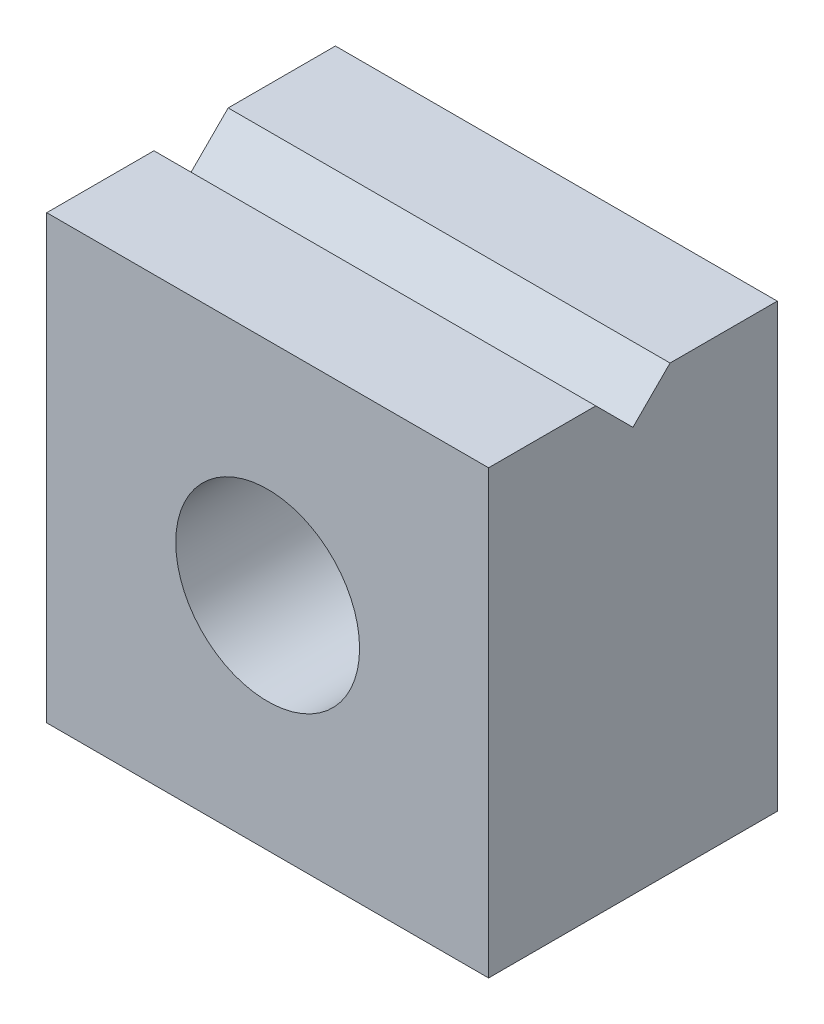
ISO-10303-21;
HEADER;
FILE_DESCRIPTION(('STEP AP214'),'2;1');
FILE_NAME('part.step','',(''),(''),'','','');
FILE_SCHEMA(('AUTOMOTIVE_DESIGN { 1 0 10303 214 1 1 1 1 }'));
ENDSEC;
DATA;
#1=APPLICATION_CONTEXT('core data for automotive mechanical design processes');
#2=APPLICATION_PROTOCOL_DEFINITION('international standard','automotive_design',2000,#1);
#3=PRODUCT_CONTEXT('',#1,'mechanical');
#4=PRODUCT('Part','Part','',(#3));
#5=PRODUCT_RELATED_PRODUCT_CATEGORY('part','',(#4));
#6=PRODUCT_DEFINITION_FORMATION('','',#4);
#7=PRODUCT_DEFINITION_CONTEXT('part definition',#1,'design');
#8=PRODUCT_DEFINITION('design','',#6,#7);
#9=PRODUCT_DEFINITION_SHAPE('','',#8);
#10=(LENGTH_UNIT() NAMED_UNIT(*) SI_UNIT(.MILLI.,.METRE.));
#11=(NAMED_UNIT(*) PLANE_ANGLE_UNIT() SI_UNIT($,.RADIAN.));
#12=(NAMED_UNIT(*) SI_UNIT($,.STERADIAN.) SOLID_ANGLE_UNIT());
#13=UNCERTAINTY_MEASURE_WITH_UNIT(LENGTH_MEASURE(1.E-05),#10,'distance_accuracy_value','');
#14=(GEOMETRIC_REPRESENTATION_CONTEXT(3) GLOBAL_UNCERTAINTY_ASSIGNED_CONTEXT((#13)) GLOBAL_UNIT_ASSIGNED_CONTEXT((#10,
#11,#12)) REPRESENTATION_CONTEXT('',''));
#15=CARTESIAN_POINT('',(0.,0.,0.));
#16=DIRECTION('',(0.,0.,1.));
#17=DIRECTION('',(1.,0.,0.));
#18=AXIS2_PLACEMENT_3D('',#15,#16,#17);
#19=CARTESIAN_POINT('',(-3.75,3.75,4.9));
#20=DIRECTION('',(0.,-1.,0.));
#21=DIRECTION('',(0.,0.,-1.));
#22=AXIS2_PLACEMENT_3D('',#19,#20,#21);
#23=PLANE('',#22);
#24=DIRECTION('',(0.,0.,-1.));
#25=VECTOR('',#24,1.);
#26=CARTESIAN_POINT('',(-3.75,3.75,4.9));
#27=LINE('',#26,#25);
#28=CARTESIAN_POINT('',(-3.75,3.75,1.82));
#29=VERTEX_POINT('',#28);
#30=CARTESIAN_POINT('',(-3.75,3.75,0.));
#31=VERTEX_POINT('',#30);
#32=EDGE_CURVE('E122',#29,#31,#27,.T.);
#33=ORIENTED_EDGE('',*,*,#32,.F.);
#34=DIRECTION('',(1.,0.,0.));
#35=VECTOR('',#34,1.);
#36=CARTESIAN_POINT('',(-3.75,3.75,1.82));
#37=LINE('',#36,#35);
#38=CARTESIAN_POINT('',(3.75,3.75,1.82));
#39=VERTEX_POINT('',#38);
#40=EDGE_CURVE('E109',#29,#39,#37,.T.);
#41=ORIENTED_EDGE('',*,*,#40,.T.);
#42=DIRECTION('',(0.,0.,-1.));
#43=VECTOR('',#42,1.);
#44=CARTESIAN_POINT('',(3.75,3.75,4.9));
#45=LINE('',#44,#43);
#46=CARTESIAN_POINT('',(3.75,3.75,0.));
#47=VERTEX_POINT('',#46);
#48=EDGE_CURVE('E48',#39,#47,#45,.T.);
#49=ORIENTED_EDGE('',*,*,#48,.T.);
#50=DIRECTION('',(-1.,0.,0.));
#51=VECTOR('',#50,1.);
#52=CARTESIAN_POINT('',(-3.75,3.75,0.));
#53=LINE('',#52,#51);
#54=EDGE_CURVE('E151',#47,#31,#53,.T.);
#55=ORIENTED_EDGE('',*,*,#54,.T.);
#56=EDGE_LOOP('',(#33,#41,#49,#55));
#57=FACE_BOUND('',#56,.T.);
#58=ADVANCED_FACE('F39',(#57),#23,.F.);
#59=CARTESIAN_POINT('',(0.,0.,4.9));
#60=DIRECTION('',(0.,0.,-1.));
#61=DIRECTION('',(-1.,0.,0.));
#62=AXIS2_PLACEMENT_3D('',#59,#60,#61);
#63=PLANE('',#62);
#64=DIRECTION('',(0.,1.,0.));
#65=VECTOR('',#64,1.);
#66=CARTESIAN_POINT('',(3.75,-3.75,4.9));
#67=LINE('',#66,#65);
#68=CARTESIAN_POINT('',(3.75,-3.75,4.9));
#69=VERTEX_POINT('',#68);
#70=CARTESIAN_POINT('',(3.75,3.75,4.9));
#71=VERTEX_POINT('',#70);
#72=EDGE_CURVE('E147',#69,#71,#67,.T.);
#73=ORIENTED_EDGE('',*,*,#72,.T.);
#74=DIRECTION('',(-1.,0.,0.));
#75=VECTOR('',#74,1.);
#76=CARTESIAN_POINT('',(-3.75,3.75,4.9));
#77=LINE('',#76,#75);
#78=CARTESIAN_POINT('',(-3.75,3.75,4.9));
#79=VERTEX_POINT('',#78);
#80=EDGE_CURVE('E92',#71,#79,#77,.T.);
#81=ORIENTED_EDGE('',*,*,#80,.T.);
#82=DIRECTION('',(0.,-1.,0.));
#83=VECTOR('',#82,1.);
#84=CARTESIAN_POINT('',(-3.75,-3.75,4.9));
#85=LINE('',#84,#83);
#86=CARTESIAN_POINT('',(-3.75,-3.75,4.9));
#87=VERTEX_POINT('',#86);
#88=EDGE_CURVE('E159',#79,#87,#85,.T.);
#89=ORIENTED_EDGE('',*,*,#88,.T.);
#90=DIRECTION('',(1.,0.,0.));
#91=VECTOR('',#90,1.);
#92=CARTESIAN_POINT('',(-3.75,-3.75,4.9));
#93=LINE('',#92,#91);
#94=EDGE_CURVE('E64',#87,#69,#93,.T.);
#95=ORIENTED_EDGE('',*,*,#94,.T.);
#96=EDGE_LOOP('',(#73,#81,#89,#95));
#97=FACE_BOUND('',#96,.T.);
#98=CARTESIAN_POINT('',(0.,0.,4.9));
#99=DIRECTION('',(0.,0.,1.));
#100=DIRECTION('',(1.,0.,0.));
#101=AXIS2_PLACEMENT_3D('',#98,#99,#100);
#102=CIRCLE('',#101,1.56);
#103=CARTESIAN_POINT('',(1.56,0.,4.9));
#104=VERTEX_POINT('',#103);
#105=EDGE_CURVE('E156',#104,#104,#102,.T.);
#106=ORIENTED_EDGE('',*,*,#105,.F.);
#107=EDGE_LOOP('',(#106));
#108=FACE_BOUND('',#107,.T.);
#109=ADVANCED_FACE('F190',(#97,#108),#63,.F.);
#110=CARTESIAN_POINT('',(0.,0.,0.));
#111=DIRECTION('',(0.,0.,-1.));
#112=DIRECTION('',(-1.,0.,0.));
#113=AXIS2_PLACEMENT_3D('',#110,#111,#112);
#114=PLANE('',#113);
#115=DIRECTION('',(0.,1.,0.));
#116=VECTOR('',#115,1.);
#117=CARTESIAN_POINT('',(3.75,-3.75,0.));
#118=LINE('',#117,#116);
#119=CARTESIAN_POINT('',(3.75,-3.75,0.));
#120=VERTEX_POINT('',#119);
#121=EDGE_CURVE('E129',#120,#47,#118,.T.);
#122=ORIENTED_EDGE('',*,*,#121,.F.);
#123=DIRECTION('',(1.,0.,0.));
#124=VECTOR('',#123,1.);
#125=CARTESIAN_POINT('',(-3.75,-3.75,0.));
#126=LINE('',#125,#124);
#127=CARTESIAN_POINT('',(-3.75,-3.75,0.));
#128=VERTEX_POINT('',#127);
#129=EDGE_CURVE('E85',#128,#120,#126,.T.);
#130=ORIENTED_EDGE('',*,*,#129,.F.);
#131=DIRECTION('',(0.,-1.,0.));
#132=VECTOR('',#131,1.);
#133=CARTESIAN_POINT('',(-3.75,-3.75,0.));
#134=LINE('',#133,#132);
#135=EDGE_CURVE('E148',#31,#128,#134,.T.);
#136=ORIENTED_EDGE('',*,*,#135,.F.);
#137=ORIENTED_EDGE('',*,*,#54,.F.);
#138=EDGE_LOOP('',(#122,#130,#136,#137));
#139=FACE_BOUND('',#138,.T.);
#140=CARTESIAN_POINT('',(0.,0.,0.));
#141=DIRECTION('',(0.,0.,1.));
#142=DIRECTION('',(1.,0.,0.));
#143=AXIS2_PLACEMENT_3D('',#140,#141,#142);
#144=CIRCLE('',#143,1.56);
#145=CARTESIAN_POINT('',(1.56,0.,0.));
#146=VERTEX_POINT('',#145);
#147=EDGE_CURVE('E166',#146,#146,#144,.T.);
#148=ORIENTED_EDGE('',*,*,#147,.T.);
#149=EDGE_LOOP('',(#148));
#150=FACE_BOUND('',#149,.T.);
#151=ADVANCED_FACE('F193',(#139,#150),#114,.T.);
#152=CARTESIAN_POINT('',(3.75,-3.75,4.9));
#153=DIRECTION('',(-1.,0.,0.));
#154=DIRECTION('',(0.,0.,1.));
#155=AXIS2_PLACEMENT_3D('',#152,#153,#154);
#156=PLANE('',#155);
#157=ORIENTED_EDGE('',*,*,#48,.F.);
#158=DIRECTION('',(0.,0.707106781186546,-0.707106781186549));
#159=VECTOR('',#158,1.);
#160=CARTESIAN_POINT('',(3.75,3.12,2.45));
#161=LINE('',#160,#159);
#162=CARTESIAN_POINT('',(3.75,3.12,2.45));
#163=VERTEX_POINT('',#162);
#164=EDGE_CURVE('E106',#163,#39,#161,.T.);
#165=ORIENTED_EDGE('',*,*,#164,.F.);
#166=DIRECTION('',(0.,-0.707106781186546,-0.707106781186549));
#167=VECTOR('',#166,1.);
#168=CARTESIAN_POINT('',(3.75,3.12,2.45));
#169=LINE('',#168,#167);
#170=CARTESIAN_POINT('',(3.75,3.75,3.08));
#171=VERTEX_POINT('',#170);
#172=EDGE_CURVE('E116',#171,#163,#169,.T.);
#173=ORIENTED_EDGE('',*,*,#172,.F.);
#174=EDGE_CURVE('E11',#71,#171,#45,.T.);
#175=ORIENTED_EDGE('',*,*,#174,.F.);
#176=ORIENTED_EDGE('',*,*,#72,.F.);
#177=DIRECTION('',(0.,0.,-1.));
#178=VECTOR('',#177,1.);
#179=CARTESIAN_POINT('',(3.75,-3.75,4.9));
#180=LINE('',#179,#178);
#181=EDGE_CURVE('E142',#69,#120,#180,.T.);
#182=ORIENTED_EDGE('',*,*,#181,.T.);
#183=ORIENTED_EDGE('',*,*,#121,.T.);
#184=EDGE_LOOP('',(#157,#165,#173,#175,#176,#182,#183));
#185=FACE_BOUND('',#184,.T.);
#186=ADVANCED_FACE('F41',(#185),#156,.F.);
#187=ORIENTED_EDGE('',*,*,#174,.T.);
#188=DIRECTION('',(1.,0.,0.));
#189=VECTOR('',#188,1.);
#190=CARTESIAN_POINT('',(-3.75,3.75,3.08));
#191=LINE('',#190,#189);
#192=CARTESIAN_POINT('',(-3.75,3.75,3.08));
#193=VERTEX_POINT('',#192);
#194=EDGE_CURVE('E124',#193,#171,#191,.T.);
#195=ORIENTED_EDGE('',*,*,#194,.F.);
#196=EDGE_CURVE('E131',#79,#193,#27,.T.);
#197=ORIENTED_EDGE('',*,*,#196,.F.);
#198=ORIENTED_EDGE('',*,*,#80,.F.);
#199=EDGE_LOOP('',(#187,#195,#197,#198));
#200=FACE_BOUND('',#199,.T.);
#201=ADVANCED_FACE('F187',(#200),#23,.F.);
#202=CARTESIAN_POINT('',(-3.75,-3.75,4.9));
#203=DIRECTION('',(1.,0.,0.));
#204=DIRECTION('',(0.,0.,-1.));
#205=AXIS2_PLACEMENT_3D('',#202,#203,#204);
#206=PLANE('',#205);
#207=DIRECTION('',(0.,-0.707106781186546,-0.707106781186549));
#208=VECTOR('',#207,1.);
#209=CARTESIAN_POINT('',(-3.75,3.12,2.45));
#210=LINE('',#209,#208);
#211=CARTESIAN_POINT('',(-3.75,3.12,2.45));
#212=VERTEX_POINT('',#211);
#213=EDGE_CURVE('E125',#193,#212,#210,.T.);
#214=ORIENTED_EDGE('',*,*,#213,.T.);
#215=DIRECTION('',(0.,0.707106781186546,-0.707106781186549));
#216=VECTOR('',#215,1.);
#217=CARTESIAN_POINT('',(-3.75,3.12,2.45));
#218=LINE('',#217,#216);
#219=EDGE_CURVE('E55',#212,#29,#218,.T.);
#220=ORIENTED_EDGE('',*,*,#219,.T.);
#221=ORIENTED_EDGE('',*,*,#32,.T.);
#222=ORIENTED_EDGE('',*,*,#135,.T.);
#223=DIRECTION('',(0.,0.,-1.));
#224=VECTOR('',#223,1.);
#225=CARTESIAN_POINT('',(-3.75,-3.75,4.9));
#226=LINE('',#225,#224);
#227=EDGE_CURVE('E138',#87,#128,#226,.T.);
#228=ORIENTED_EDGE('',*,*,#227,.F.);
#229=ORIENTED_EDGE('',*,*,#88,.F.);
#230=ORIENTED_EDGE('',*,*,#196,.T.);
#231=EDGE_LOOP('',(#214,#220,#221,#222,#228,#229,#230));
#232=FACE_BOUND('',#231,.T.);
#233=ADVANCED_FACE('F189',(#232),#206,.F.);
#234=CARTESIAN_POINT('',(-3.75,-3.75,4.9));
#235=DIRECTION('',(0.,1.,0.));
#236=DIRECTION('',(0.,0.,1.));
#237=AXIS2_PLACEMENT_3D('',#234,#235,#236);
#238=PLANE('',#237);
#239=ORIENTED_EDGE('',*,*,#129,.T.);
#240=ORIENTED_EDGE('',*,*,#181,.F.);
#241=ORIENTED_EDGE('',*,*,#94,.F.);
#242=ORIENTED_EDGE('',*,*,#227,.T.);
#243=EDGE_LOOP('',(#239,#240,#241,#242));
#244=FACE_BOUND('',#243,.T.);
#245=ADVANCED_FACE('F196',(#244),#238,.F.);
#246=CARTESIAN_POINT('',(0.,0.,4.9));
#247=DIRECTION('',(0.,0.,-1.));
#248=DIRECTION('',(-1.,0.,0.));
#249=AXIS2_PLACEMENT_3D('',#246,#247,#248);
#250=CYLINDRICAL_SURFACE('',#249,1.56);
#251=ORIENTED_EDGE('',*,*,#105,.T.);
#252=EDGE_LOOP('',(#251));
#253=FACE_BOUND('',#252,.T.);
#254=ORIENTED_EDGE('',*,*,#147,.F.);
#255=EDGE_LOOP('',(#254));
#256=FACE_BOUND('',#255,.T.);
#257=ADVANCED_FACE('F198',(#253,#256),#250,.F.);
#258=CARTESIAN_POINT('',(-3.75,3.12,2.45));
#259=DIRECTION('',(0.,-0.707106781186549,-0.707106781186546));
#260=DIRECTION('',(0.,0.707106781186546,-0.707106781186549));
#261=AXIS2_PLACEMENT_3D('',#258,#259,#260);
#262=PLANE('',#261);
#263=ORIENTED_EDGE('',*,*,#40,.F.);
#264=ORIENTED_EDGE('',*,*,#219,.F.);
#265=DIRECTION('',(1.,0.,0.));
#266=VECTOR('',#265,1.);
#267=CARTESIAN_POINT('',(-3.75,3.12,2.45));
#268=LINE('',#267,#266);
#269=EDGE_CURVE('E110',#212,#163,#268,.T.);
#270=ORIENTED_EDGE('',*,*,#269,.T.);
#271=ORIENTED_EDGE('',*,*,#164,.T.);
#272=EDGE_LOOP('',(#263,#264,#270,#271));
#273=FACE_BOUND('',#272,.T.);
#274=ADVANCED_FACE('F108',(#273),#262,.F.);
#275=CARTESIAN_POINT('',(-3.75,3.12,2.45));
#276=DIRECTION('',(0.,-0.707106781186549,0.707106781186546));
#277=DIRECTION('',(0.,-0.707106781186546,-0.707106781186549));
#278=AXIS2_PLACEMENT_3D('',#275,#276,#277);
#279=PLANE('',#278);
#280=ORIENTED_EDGE('',*,*,#269,.F.);
#281=ORIENTED_EDGE('',*,*,#213,.F.);
#282=ORIENTED_EDGE('',*,*,#194,.T.);
#283=ORIENTED_EDGE('',*,*,#172,.T.);
#284=EDGE_LOOP('',(#280,#281,#282,#283));
#285=FACE_BOUND('',#284,.T.);
#286=ADVANCED_FACE('F183',(#285),#279,.F.);
#287=CLOSED_SHELL('',(#58,#109,#151,#186,#201,#233,#245,#257,#274,#286));
#288=MANIFOLD_SOLID_BREP('B2',#287);
#289=ADVANCED_BREP_SHAPE_REPRESENTATION('',(#18,#288),#14);
#290=SHAPE_DEFINITION_REPRESENTATION(#9,#289);
ENDSEC;
END-ISO-10303-21;
